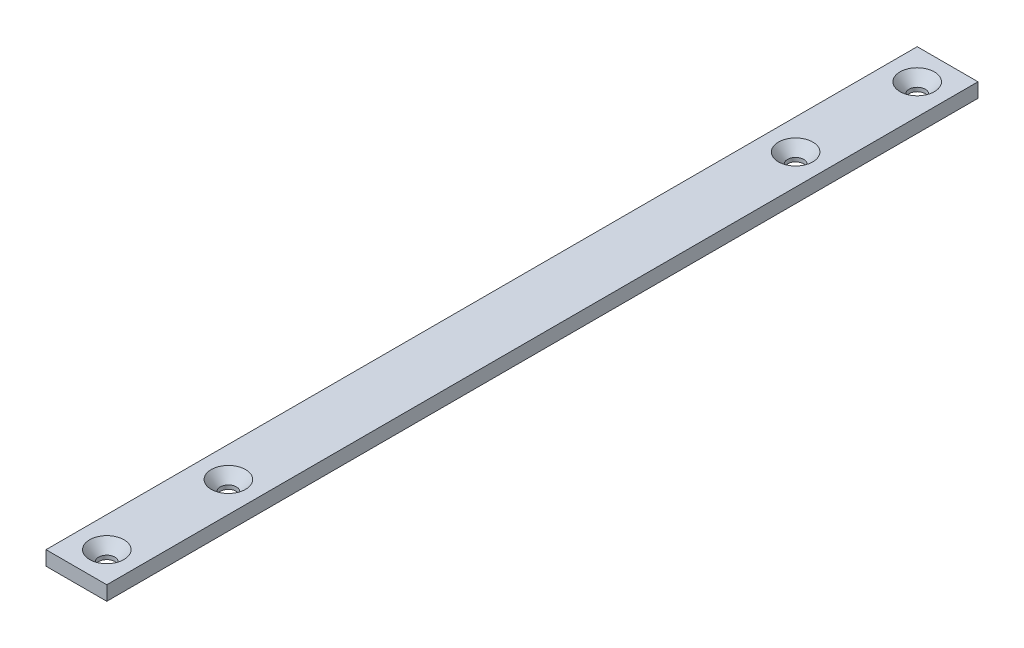
ISO-10303-21;
HEADER;
FILE_DESCRIPTION(('STEP AP214'),'2;1');
FILE_NAME('part.step','',(''),(''),'','','');
FILE_SCHEMA(('AUTOMOTIVE_DESIGN { 1 0 10303 214 1 1 1 1 }'));
ENDSEC;
DATA;
#1=APPLICATION_CONTEXT('core data for automotive mechanical design processes');
#2=APPLICATION_PROTOCOL_DEFINITION('international standard','automotive_design',2000,#1);
#3=PRODUCT_CONTEXT('',#1,'mechanical');
#4=PRODUCT('Part','Part','',(#3));
#5=PRODUCT_RELATED_PRODUCT_CATEGORY('part','',(#4));
#6=PRODUCT_DEFINITION_FORMATION('','',#4);
#7=PRODUCT_DEFINITION_CONTEXT('part definition',#1,'design');
#8=PRODUCT_DEFINITION('design','',#6,#7);
#9=PRODUCT_DEFINITION_SHAPE('','',#8);
#10=(LENGTH_UNIT() NAMED_UNIT(*) SI_UNIT(.MILLI.,.METRE.));
#11=(NAMED_UNIT(*) PLANE_ANGLE_UNIT() SI_UNIT($,.RADIAN.));
#12=(NAMED_UNIT(*) SI_UNIT($,.STERADIAN.) SOLID_ANGLE_UNIT());
#13=UNCERTAINTY_MEASURE_WITH_UNIT(LENGTH_MEASURE(1.E-05),#10,'distance_accuracy_value','');
#14=(GEOMETRIC_REPRESENTATION_CONTEXT(3) GLOBAL_UNCERTAINTY_ASSIGNED_CONTEXT((#13)) GLOBAL_UNIT_ASSIGNED_CONTEXT((#10,
#11,#12)) REPRESENTATION_CONTEXT('',''));
#15=CARTESIAN_POINT('',(0.,0.,0.));
#16=DIRECTION('',(0.,0.,1.));
#17=DIRECTION('',(1.,0.,0.));
#18=AXIS2_PLACEMENT_3D('',#15,#16,#17);
#19=CARTESIAN_POINT('',(-12.7,-3.,182.));
#20=DIRECTION('',(1.,0.,0.));
#21=DIRECTION('',(0.,0.,-1.));
#22=AXIS2_PLACEMENT_3D('',#19,#20,#21);
#23=PLANE('',#22);
#24=DIRECTION('',(0.,-1.,0.));
#25=VECTOR('',#24,1.);
#26=CARTESIAN_POINT('',(-12.7,-3.,-182.));
#27=LINE('',#26,#25);
#28=CARTESIAN_POINT('',(-12.7,3.,-182.));
#29=VERTEX_POINT('',#28);
#30=CARTESIAN_POINT('',(-12.7,-3.,-182.));
#31=VERTEX_POINT('',#30);
#32=EDGE_CURVE('E107',#29,#31,#27,.T.);
#33=ORIENTED_EDGE('',*,*,#32,.T.);
#34=DIRECTION('',(0.,0.,-1.));
#35=VECTOR('',#34,1.);
#36=CARTESIAN_POINT('',(-12.7,-3.,182.));
#37=LINE('',#36,#35);
#38=CARTESIAN_POINT('',(-12.7,-3.,182.));
#39=VERTEX_POINT('',#38);
#40=EDGE_CURVE('E11',#39,#31,#37,.T.);
#41=ORIENTED_EDGE('',*,*,#40,.F.);
#42=DIRECTION('',(0.,-1.,0.));
#43=VECTOR('',#42,1.);
#44=CARTESIAN_POINT('',(-12.7,-3.,182.));
#45=LINE('',#44,#43);
#46=CARTESIAN_POINT('',(-12.7,3.,182.));
#47=VERTEX_POINT('',#46);
#48=EDGE_CURVE('E91',#47,#39,#45,.T.);
#49=ORIENTED_EDGE('',*,*,#48,.F.);
#50=DIRECTION('',(0.,0.,-1.));
#51=VECTOR('',#50,1.);
#52=CARTESIAN_POINT('',(-12.7,3.,182.));
#53=LINE('',#52,#51);
#54=EDGE_CURVE('E103',#47,#29,#53,.T.);
#55=ORIENTED_EDGE('',*,*,#54,.T.);
#56=EDGE_LOOP('',(#33,#41,#49,#55));
#57=FACE_BOUND('',#56,.T.);
#58=ADVANCED_FACE('F39',(#57),#23,.F.);
#59=CARTESIAN_POINT('',(12.7,-3.,182.));
#60=DIRECTION('',(0.,1.,0.));
#61=DIRECTION('',(-1.,0.,0.));
#62=AXIS2_PLACEMENT_3D('',#59,#60,#61);
#63=PLANE('',#62);
#64=CARTESIAN_POINT('',(0.,-3.,-169.3));
#65=DIRECTION('',(0.,1.,0.));
#66=DIRECTION('',(0.,0.,1.));
#67=AXIS2_PLACEMENT_3D('',#64,#65,#66);
#68=CIRCLE('',#67,3.3782);
#69=CARTESIAN_POINT('',(0.,-3.,-165.9218));
#70=VERTEX_POINT('',#69);
#71=EDGE_CURVE('E163',#70,#70,#68,.T.);
#72=ORIENTED_EDGE('',*,*,#71,.T.);
#73=EDGE_LOOP('',(#72));
#74=FACE_BOUND('',#73,.T.);
#75=CARTESIAN_POINT('',(0.,-3.,169.3));
#76=DIRECTION('',(0.,1.,0.));
#77=DIRECTION('',(0.,0.,1.));
#78=AXIS2_PLACEMENT_3D('',#75,#76,#77);
#79=CIRCLE('',#78,3.3782);
#80=CARTESIAN_POINT('',(0.,-3.,172.6782));
#81=VERTEX_POINT('',#80);
#82=EDGE_CURVE('E151',#81,#81,#79,.T.);
#83=ORIENTED_EDGE('',*,*,#82,.T.);
#84=EDGE_LOOP('',(#83));
#85=FACE_BOUND('',#84,.T.);
#86=CARTESIAN_POINT('',(0.,-3.,-118.5));
#87=DIRECTION('',(0.,1.,0.));
#88=DIRECTION('',(0.,0.,1.));
#89=AXIS2_PLACEMENT_3D('',#86,#87,#88);
#90=CIRCLE('',#89,3.3782);
#91=CARTESIAN_POINT('',(0.,-3.,-115.1218));
#92=VERTEX_POINT('',#91);
#93=EDGE_CURVE('E139',#92,#92,#90,.T.);
#94=ORIENTED_EDGE('',*,*,#93,.T.);
#95=EDGE_LOOP('',(#94));
#96=FACE_BOUND('',#95,.T.);
#97=CARTESIAN_POINT('',(0.,-3.,118.5));
#98=DIRECTION('',(0.,1.,0.));
#99=DIRECTION('',(0.,0.,1.));
#100=AXIS2_PLACEMENT_3D('',#97,#98,#99);
#101=CIRCLE('',#100,3.3782);
#102=CARTESIAN_POINT('',(0.,-3.,121.8782));
#103=VERTEX_POINT('',#102);
#104=EDGE_CURVE('E111',#103,#103,#101,.T.);
#105=ORIENTED_EDGE('',*,*,#104,.T.);
#106=EDGE_LOOP('',(#105));
#107=FACE_BOUND('',#106,.T.);
#108=DIRECTION('',(1.,0.,0.));
#109=VECTOR('',#108,1.);
#110=CARTESIAN_POINT('',(12.7,-3.,-182.));
#111=LINE('',#110,#109);
#112=CARTESIAN_POINT('',(12.7,-3.,-182.));
#113=VERTEX_POINT('',#112);
#114=EDGE_CURVE('E96',#31,#113,#111,.T.);
#115=ORIENTED_EDGE('',*,*,#114,.T.);
#116=DIRECTION('',(0.,0.,-1.));
#117=VECTOR('',#116,1.);
#118=CARTESIAN_POINT('',(12.7,-3.,182.));
#119=LINE('',#118,#117);
#120=CARTESIAN_POINT('',(12.7,-3.,182.));
#121=VERTEX_POINT('',#120);
#122=EDGE_CURVE('E48',#121,#113,#119,.T.);
#123=ORIENTED_EDGE('',*,*,#122,.F.);
#124=DIRECTION('',(1.,0.,0.));
#125=VECTOR('',#124,1.);
#126=CARTESIAN_POINT('',(12.7,-3.,182.));
#127=LINE('',#126,#125);
#128=EDGE_CURVE('E86',#39,#121,#127,.T.);
#129=ORIENTED_EDGE('',*,*,#128,.F.);
#130=ORIENTED_EDGE('',*,*,#40,.T.);
#131=EDGE_LOOP('',(#115,#123,#129,#130));
#132=FACE_BOUND('',#131,.T.);
#133=ADVANCED_FACE('F95',(#74,#85,#96,#107,#132),#63,.F.);
#134=CARTESIAN_POINT('',(12.7,-3.,182.));
#135=DIRECTION('',(-1.,0.,0.));
#136=DIRECTION('',(0.,0.,1.));
#137=AXIS2_PLACEMENT_3D('',#134,#135,#136);
#138=PLANE('',#137);
#139=DIRECTION('',(0.,1.,0.));
#140=VECTOR('',#139,1.);
#141=CARTESIAN_POINT('',(12.7,-3.,-182.));
#142=LINE('',#141,#140);
#143=CARTESIAN_POINT('',(12.7,3.,-182.));
#144=VERTEX_POINT('',#143);
#145=EDGE_CURVE('E73',#113,#144,#142,.T.);
#146=ORIENTED_EDGE('',*,*,#145,.T.);
#147=DIRECTION('',(0.,0.,-1.));
#148=VECTOR('',#147,1.);
#149=CARTESIAN_POINT('',(12.7,3.,182.));
#150=LINE('',#149,#148);
#151=CARTESIAN_POINT('',(12.7,3.,182.));
#152=VERTEX_POINT('',#151);
#153=EDGE_CURVE('E98',#152,#144,#150,.T.);
#154=ORIENTED_EDGE('',*,*,#153,.F.);
#155=DIRECTION('',(0.,1.,0.));
#156=VECTOR('',#155,1.);
#157=CARTESIAN_POINT('',(12.7,-3.,182.));
#158=LINE('',#157,#156);
#159=EDGE_CURVE('E89',#121,#152,#158,.T.);
#160=ORIENTED_EDGE('',*,*,#159,.F.);
#161=ORIENTED_EDGE('',*,*,#122,.T.);
#162=EDGE_LOOP('',(#146,#154,#160,#161));
#163=FACE_BOUND('',#162,.T.);
#164=ADVANCED_FACE('F99',(#163),#138,.F.);
#165=CARTESIAN_POINT('',(12.7,3.,182.));
#166=DIRECTION('',(0.,-1.,0.));
#167=DIRECTION('',(1.,0.,0.));
#168=AXIS2_PLACEMENT_3D('',#165,#166,#167);
#169=PLANE('',#168);
#170=CARTESIAN_POINT('',(0.,3.,-169.3));
#171=DIRECTION('',(0.,1.,0.));
#172=DIRECTION('',(0.,0.,1.));
#173=AXIS2_PLACEMENT_3D('',#170,#171,#172);
#174=CIRCLE('',#173,7.1783448);
#175=CARTESIAN_POINT('',(0.,3.,-162.1216552));
#176=VERTEX_POINT('',#175);
#177=EDGE_CURVE('E171',#176,#176,#174,.T.);
#178=ORIENTED_EDGE('',*,*,#177,.F.);
#179=EDGE_LOOP('',(#178));
#180=FACE_BOUND('',#179,.T.);
#181=CARTESIAN_POINT('',(0.,3.,169.3));
#182=DIRECTION('',(0.,1.,0.));
#183=DIRECTION('',(0.,0.,1.));
#184=AXIS2_PLACEMENT_3D('',#181,#182,#183);
#185=CIRCLE('',#184,7.1783448);
#186=CARTESIAN_POINT('',(0.,3.,176.4783448));
#187=VERTEX_POINT('',#186);
#188=EDGE_CURVE('E159',#187,#187,#185,.T.);
#189=ORIENTED_EDGE('',*,*,#188,.F.);
#190=EDGE_LOOP('',(#189));
#191=FACE_BOUND('',#190,.T.);
#192=CARTESIAN_POINT('',(0.,3.,-118.5));
#193=DIRECTION('',(0.,1.,0.));
#194=DIRECTION('',(0.,0.,1.));
#195=AXIS2_PLACEMENT_3D('',#192,#193,#194);
#196=CIRCLE('',#195,7.1783448);
#197=CARTESIAN_POINT('',(0.,3.,-111.3216552));
#198=VERTEX_POINT('',#197);
#199=EDGE_CURVE('E147',#198,#198,#196,.T.);
#200=ORIENTED_EDGE('',*,*,#199,.F.);
#201=EDGE_LOOP('',(#200));
#202=FACE_BOUND('',#201,.T.);
#203=CARTESIAN_POINT('',(0.,3.,118.5));
#204=DIRECTION('',(0.,1.,0.));
#205=DIRECTION('',(0.,0.,1.));
#206=AXIS2_PLACEMENT_3D('',#203,#204,#205);
#207=CIRCLE('',#206,7.1783448);
#208=CARTESIAN_POINT('',(0.,3.,125.6783448));
#209=VERTEX_POINT('',#208);
#210=EDGE_CURVE('E135',#209,#209,#207,.T.);
#211=ORIENTED_EDGE('',*,*,#210,.F.);
#212=EDGE_LOOP('',(#211));
#213=FACE_BOUND('',#212,.T.);
#214=DIRECTION('',(-1.,0.,0.));
#215=VECTOR('',#214,1.);
#216=CARTESIAN_POINT('',(12.7,3.,-182.));
#217=LINE('',#216,#215);
#218=EDGE_CURVE('E79',#144,#29,#217,.T.);
#219=ORIENTED_EDGE('',*,*,#218,.T.);
#220=ORIENTED_EDGE('',*,*,#54,.F.);
#221=DIRECTION('',(-1.,0.,0.));
#222=VECTOR('',#221,1.);
#223=CARTESIAN_POINT('',(12.7,3.,182.));
#224=LINE('',#223,#222);
#225=EDGE_CURVE('E56',#152,#47,#224,.T.);
#226=ORIENTED_EDGE('',*,*,#225,.F.);
#227=ORIENTED_EDGE('',*,*,#153,.T.);
#228=EDGE_LOOP('',(#219,#220,#226,#227));
#229=FACE_BOUND('',#228,.T.);
#230=ADVANCED_FACE('F121',(#180,#191,#202,#213,#229),#169,.F.);
#231=CARTESIAN_POINT('',(0.,0.,182.));
#232=DIRECTION('',(0.,0.,1.));
#233=DIRECTION('',(1.,0.,0.));
#234=AXIS2_PLACEMENT_3D('',#231,#232,#233);
#235=PLANE('',#234);
#236=ORIENTED_EDGE('',*,*,#48,.T.);
#237=ORIENTED_EDGE('',*,*,#128,.T.);
#238=ORIENTED_EDGE('',*,*,#159,.T.);
#239=ORIENTED_EDGE('',*,*,#225,.T.);
#240=EDGE_LOOP('',(#236,#237,#238,#239));
#241=FACE_BOUND('',#240,.T.);
#242=ADVANCED_FACE('F87',(#241),#235,.T.);
#243=CARTESIAN_POINT('',(0.,0.,-182.));
#244=DIRECTION('',(0.,0.,1.));
#245=DIRECTION('',(1.,0.,0.));
#246=AXIS2_PLACEMENT_3D('',#243,#244,#245);
#247=PLANE('',#246);
#248=ORIENTED_EDGE('',*,*,#32,.F.);
#249=ORIENTED_EDGE('',*,*,#218,.F.);
#250=ORIENTED_EDGE('',*,*,#145,.F.);
#251=ORIENTED_EDGE('',*,*,#114,.F.);
#252=EDGE_LOOP('',(#248,#249,#250,#251));
#253=FACE_BOUND('',#252,.T.);
#254=ADVANCED_FACE('F124',(#253),#247,.F.);
#255=CARTESIAN_POINT('',(0.,3.,118.5));
#256=DIRECTION('',(0.,1.,0.));
#257=DIRECTION('',(0.,0.,1.));
#258=AXIS2_PLACEMENT_3D('',#255,#256,#257);
#259=CYLINDRICAL_SURFACE('',#258,3.3782);
#260=ORIENTED_EDGE('',*,*,#104,.F.);
#261=EDGE_LOOP('',(#260));
#262=FACE_BOUND('',#261,.T.);
#263=CARTESIAN_POINT('',(0.,-1.3715665207852,118.5));
#264=DIRECTION('',(0.,1.,0.));
#265=DIRECTION('',(0.,0.,1.));
#266=AXIS2_PLACEMENT_3D('',#263,#264,#265);
#267=CIRCLE('',#266,3.3782);
#268=CARTESIAN_POINT('',(0.,-1.3715665207852,121.8782));
#269=VERTEX_POINT('',#268);
#270=EDGE_CURVE('E131',#269,#269,#267,.T.);
#271=ORIENTED_EDGE('',*,*,#270,.T.);
#272=EDGE_LOOP('',(#271));
#273=FACE_BOUND('',#272,.T.);
#274=ADVANCED_FACE('F190',(#262,#273),#259,.F.);
#275=CARTESIAN_POINT('',(0.,3.,118.5));
#276=DIRECTION('',(0.,1.,0.));
#277=DIRECTION('',(0.,0.,1.));
#278=AXIS2_PLACEMENT_3D('',#275,#276,#277);
#279=CONICAL_SURFACE('',#278,7.1783448,0.715584993317675);
#280=ORIENTED_EDGE('',*,*,#270,.F.);
#281=EDGE_LOOP('',(#280));
#282=FACE_BOUND('',#281,.T.);
#283=ORIENTED_EDGE('',*,*,#210,.T.);
#284=EDGE_LOOP('',(#283));
#285=FACE_BOUND('',#284,.T.);
#286=ADVANCED_FACE('F187',(#282,#285),#279,.F.);
#287=CARTESIAN_POINT('',(0.,3.,-118.5));
#288=DIRECTION('',(0.,1.,0.));
#289=DIRECTION('',(0.,0.,1.));
#290=AXIS2_PLACEMENT_3D('',#287,#288,#289);
#291=CYLINDRICAL_SURFACE('',#290,3.3782);
#292=ORIENTED_EDGE('',*,*,#93,.F.);
#293=EDGE_LOOP('',(#292));
#294=FACE_BOUND('',#293,.T.);
#295=CARTESIAN_POINT('',(0.,-1.3715665207852,-118.5));
#296=DIRECTION('',(0.,1.,0.));
#297=DIRECTION('',(0.,0.,1.));
#298=AXIS2_PLACEMENT_3D('',#295,#296,#297);
#299=CIRCLE('',#298,3.3782);
#300=CARTESIAN_POINT('',(0.,-1.3715665207852,-115.1218));
#301=VERTEX_POINT('',#300);
#302=EDGE_CURVE('E143',#301,#301,#299,.T.);
#303=ORIENTED_EDGE('',*,*,#302,.T.);
#304=EDGE_LOOP('',(#303));
#305=FACE_BOUND('',#304,.T.);
#306=ADVANCED_FACE('F189',(#294,#305),#291,.F.);
#307=CARTESIAN_POINT('',(0.,3.,-118.5));
#308=DIRECTION('',(0.,1.,0.));
#309=DIRECTION('',(0.,0.,1.));
#310=AXIS2_PLACEMENT_3D('',#307,#308,#309);
#311=CONICAL_SURFACE('',#310,7.1783448,0.715584993317675);
#312=ORIENTED_EDGE('',*,*,#302,.F.);
#313=EDGE_LOOP('',(#312));
#314=FACE_BOUND('',#313,.T.);
#315=ORIENTED_EDGE('',*,*,#199,.T.);
#316=EDGE_LOOP('',(#315));
#317=FACE_BOUND('',#316,.T.);
#318=ADVANCED_FACE('F197',(#314,#317),#311,.F.);
#319=CARTESIAN_POINT('',(0.,3.,169.3));
#320=DIRECTION('',(0.,1.,0.));
#321=DIRECTION('',(0.,0.,1.));
#322=AXIS2_PLACEMENT_3D('',#319,#320,#321);
#323=CYLINDRICAL_SURFACE('',#322,3.3782);
#324=ORIENTED_EDGE('',*,*,#82,.F.);
#325=EDGE_LOOP('',(#324));
#326=FACE_BOUND('',#325,.T.);
#327=CARTESIAN_POINT('',(0.,-1.3715665207852,169.3));
#328=DIRECTION('',(0.,1.,0.));
#329=DIRECTION('',(0.,0.,1.));
#330=AXIS2_PLACEMENT_3D('',#327,#328,#329);
#331=CIRCLE('',#330,3.3782);
#332=CARTESIAN_POINT('',(0.,-1.3715665207852,172.6782));
#333=VERTEX_POINT('',#332);
#334=EDGE_CURVE('E155',#333,#333,#331,.T.);
#335=ORIENTED_EDGE('',*,*,#334,.T.);
#336=EDGE_LOOP('',(#335));
#337=FACE_BOUND('',#336,.T.);
#338=ADVANCED_FACE('F251',(#326,#337),#323,.F.);
#339=CARTESIAN_POINT('',(0.,3.,169.3));
#340=DIRECTION('',(0.,1.,0.));
#341=DIRECTION('',(0.,0.,1.));
#342=AXIS2_PLACEMENT_3D('',#339,#340,#341);
#343=CONICAL_SURFACE('',#342,7.1783448,0.715584993317675);
#344=ORIENTED_EDGE('',*,*,#334,.F.);
#345=EDGE_LOOP('',(#344));
#346=FACE_BOUND('',#345,.T.);
#347=ORIENTED_EDGE('',*,*,#188,.T.);
#348=EDGE_LOOP('',(#347));
#349=FACE_BOUND('',#348,.T.);
#350=ADVANCED_FACE('F261',(#346,#349),#343,.F.);
#351=CARTESIAN_POINT('',(0.,3.,-169.3));
#352=DIRECTION('',(0.,1.,0.));
#353=DIRECTION('',(0.,0.,1.));
#354=AXIS2_PLACEMENT_3D('',#351,#352,#353);
#355=CYLINDRICAL_SURFACE('',#354,3.3782);
#356=ORIENTED_EDGE('',*,*,#71,.F.);
#357=EDGE_LOOP('',(#356));
#358=FACE_BOUND('',#357,.T.);
#359=CARTESIAN_POINT('',(0.,-1.3715665207852,-169.3));
#360=DIRECTION('',(0.,1.,0.));
#361=DIRECTION('',(0.,0.,1.));
#362=AXIS2_PLACEMENT_3D('',#359,#360,#361);
#363=CIRCLE('',#362,3.3782);
#364=CARTESIAN_POINT('',(0.,-1.3715665207852,-165.9218));
#365=VERTEX_POINT('',#364);
#366=EDGE_CURVE('E167',#365,#365,#363,.T.);
#367=ORIENTED_EDGE('',*,*,#366,.T.);
#368=EDGE_LOOP('',(#367));
#369=FACE_BOUND('',#368,.T.);
#370=ADVANCED_FACE('F271',(#358,#369),#355,.F.);
#371=CARTESIAN_POINT('',(0.,3.,-169.3));
#372=DIRECTION('',(0.,1.,0.));
#373=DIRECTION('',(0.,0.,1.));
#374=AXIS2_PLACEMENT_3D('',#371,#372,#373);
#375=CONICAL_SURFACE('',#374,7.1783448,0.715584993317675);
#376=ORIENTED_EDGE('',*,*,#366,.F.);
#377=EDGE_LOOP('',(#376));
#378=FACE_BOUND('',#377,.T.);
#379=ORIENTED_EDGE('',*,*,#177,.T.);
#380=EDGE_LOOP('',(#379));
#381=FACE_BOUND('',#380,.T.);
#382=ADVANCED_FACE('F176',(#378,#381),#375,.F.);
#383=CLOSED_SHELL('',(#58,#133,#164,#230,#242,#254,#274,#286,#306,#318,#338,#350,#370,#382));
#384=MANIFOLD_SOLID_BREP('B2',#383);
#385=ADVANCED_BREP_SHAPE_REPRESENTATION('',(#18,#384),#14);
#386=SHAPE_DEFINITION_REPRESENTATION(#9,#385);
ENDSEC;
END-ISO-10303-21;
